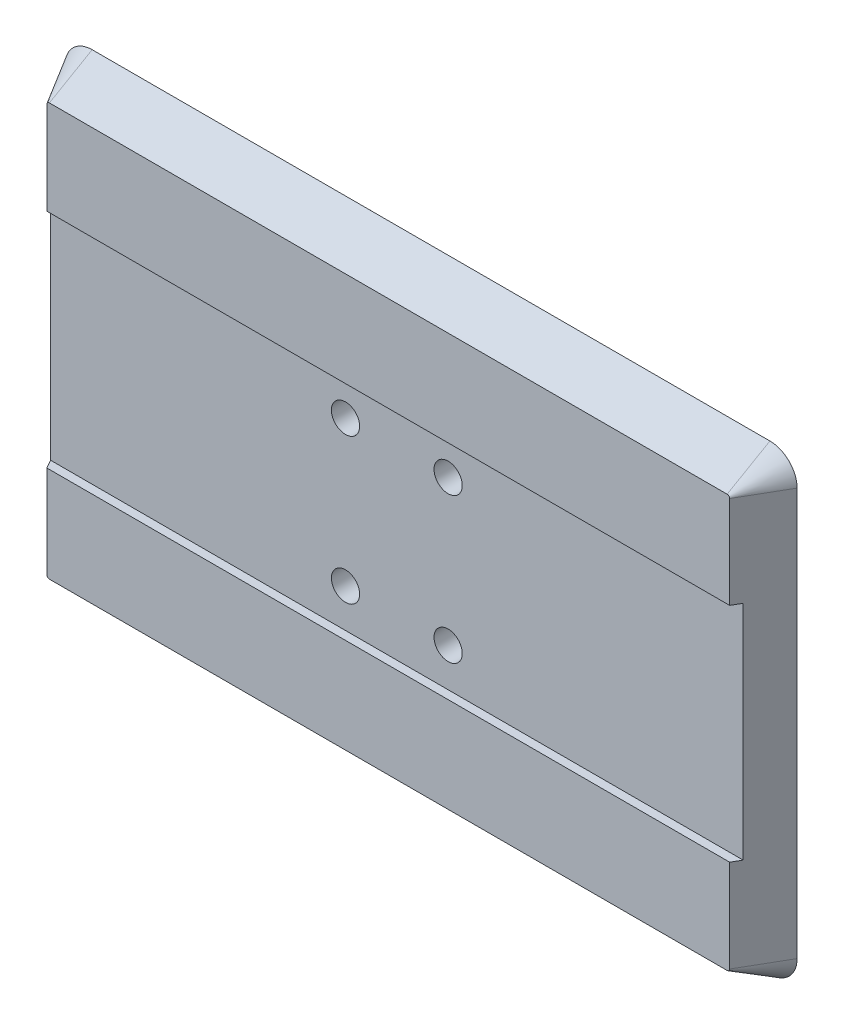
ISO-10303-21;
HEADER;
FILE_DESCRIPTION(('STEP AP214'),'2;1');
FILE_NAME('part.step','',(''),(''),'','','');
FILE_SCHEMA(('AUTOMOTIVE_DESIGN { 1 0 10303 214 1 1 1 1 }'));
ENDSEC;
DATA;
#1=APPLICATION_CONTEXT('core data for automotive mechanical design processes');
#2=APPLICATION_PROTOCOL_DEFINITION('international standard','automotive_design',2000,#1);
#3=PRODUCT_CONTEXT('',#1,'mechanical');
#4=PRODUCT('Part','Part','',(#3));
#5=PRODUCT_RELATED_PRODUCT_CATEGORY('part','',(#4));
#6=PRODUCT_DEFINITION_FORMATION('','',#4);
#7=PRODUCT_DEFINITION_CONTEXT('part definition',#1,'design');
#8=PRODUCT_DEFINITION('design','',#6,#7);
#9=PRODUCT_DEFINITION_SHAPE('','',#8);
#10=(LENGTH_UNIT() NAMED_UNIT(*) SI_UNIT(.MILLI.,.METRE.));
#11=(NAMED_UNIT(*) PLANE_ANGLE_UNIT() SI_UNIT($,.RADIAN.));
#12=(NAMED_UNIT(*) SI_UNIT($,.STERADIAN.) SOLID_ANGLE_UNIT());
#13=UNCERTAINTY_MEASURE_WITH_UNIT(LENGTH_MEASURE(1.E-05),#10,'distance_accuracy_value','');
#14=(GEOMETRIC_REPRESENTATION_CONTEXT(3) GLOBAL_UNCERTAINTY_ASSIGNED_CONTEXT((#13)) GLOBAL_UNIT_ASSIGNED_CONTEXT((#10,
#11,#12)) REPRESENTATION_CONTEXT('',''));
#15=CARTESIAN_POINT('',(0.,0.,0.));
#16=DIRECTION('',(0.,0.,1.));
#17=DIRECTION('',(1.,0.,0.));
#18=AXIS2_PLACEMENT_3D('',#15,#16,#17);
#19=CARTESIAN_POINT('',(82.42,3.18,5.));
#20=DIRECTION('',(0.,0.,1.));
#21=DIRECTION('',(1.,0.,0.));
#22=AXIS2_PLACEMENT_3D('',#19,#20,#21);
#23=PLANE('',#22);
#24=DIRECTION('',(-1.,0.,0.));
#25=VECTOR('',#24,1.);
#26=CARTESIAN_POINT('',(2.88675134594812,40.,5.));
#27=LINE('',#26,#25);
#28=CARTESIAN_POINT('',(82.7132486540519,40.,5.));
#29=VERTEX_POINT('',#28);
#30=CARTESIAN_POINT('',(2.88675134594812,40.,5.));
#31=VERTEX_POINT('',#30);
#32=EDGE_CURVE('E143',#29,#31,#27,.T.);
#33=ORIENTED_EDGE('',*,*,#32,.F.);
#34=DIRECTION('',(0.,1.,0.));
#35=VECTOR('',#34,1.);
#36=CARTESIAN_POINT('',(82.7132486540519,50.82,5.));
#37=LINE('',#36,#35);
#38=CARTESIAN_POINT('',(82.7132486540519,50.82,5.));
#39=VERTEX_POINT('',#38);
#40=EDGE_CURVE('E61',#29,#39,#37,.T.);
#41=ORIENTED_EDGE('',*,*,#40,.T.);
#42=CARTESIAN_POINT('',(82.42,50.82,5.));
#43=DIRECTION('',(0.,0.,1.));
#44=DIRECTION('',(1.,0.,0.));
#45=AXIS2_PLACEMENT_3D('',#42,#43,#44);
#46=CIRCLE('',#45,0.293248654051871);
#47=CARTESIAN_POINT('',(82.42,51.1132486540519,5.));
#48=VERTEX_POINT('',#47);
#49=EDGE_CURVE('E169',#39,#48,#46,.T.);
#50=ORIENTED_EDGE('',*,*,#49,.T.);
#51=DIRECTION('',(-1.,0.,0.));
#52=VECTOR('',#51,1.);
#53=CARTESIAN_POINT('',(3.18000000000002,51.1132486540519,5.));
#54=LINE('',#53,#52);
#55=CARTESIAN_POINT('',(3.18000000000002,51.1132486540519,5.));
#56=VERTEX_POINT('',#55);
#57=EDGE_CURVE('E165',#48,#56,#54,.T.);
#58=ORIENTED_EDGE('',*,*,#57,.T.);
#59=CARTESIAN_POINT('',(3.18,50.82,5.));
#60=DIRECTION('',(0.,0.,1.));
#61=DIRECTION('',(1.,0.,0.));
#62=AXIS2_PLACEMENT_3D('',#59,#60,#61);
#63=CIRCLE('',#62,0.29324865405187);
#64=CARTESIAN_POINT('',(2.88675134594812,50.82,5.));
#65=VERTEX_POINT('',#64);
#66=EDGE_CURVE('E161',#56,#65,#63,.T.);
#67=ORIENTED_EDGE('',*,*,#66,.T.);
#68=DIRECTION('',(0.,-1.,0.));
#69=VECTOR('',#68,1.);
#70=CARTESIAN_POINT('',(2.88675134594812,3.18,5.));
#71=LINE('',#70,#69);
#72=EDGE_CURVE('E150',#65,#31,#71,.T.);
#73=ORIENTED_EDGE('',*,*,#72,.T.);
#74=EDGE_LOOP('',(#33,#41,#50,#58,#67,#73));
#75=FACE_BOUND('',#74,.T.);
#76=ADVANCED_FACE('F37',(#75),#23,.T.);
#77=DIRECTION('',(1.,0.,0.));
#78=VECTOR('',#77,1.);
#79=CARTESIAN_POINT('',(2.88675134594812,14.,5.));
#80=LINE('',#79,#78);
#81=CARTESIAN_POINT('',(2.88675134594812,14.,5.));
#82=VERTEX_POINT('',#81);
#83=CARTESIAN_POINT('',(82.7132486540519,14.,5.));
#84=VERTEX_POINT('',#83);
#85=EDGE_CURVE('E129',#82,#84,#80,.T.);
#86=ORIENTED_EDGE('',*,*,#85,.F.);
#87=CARTESIAN_POINT('',(2.88675134594812,3.18,5.));
#88=VERTEX_POINT('',#87);
#89=EDGE_CURVE('E139',#82,#88,#71,.T.);
#90=ORIENTED_EDGE('',*,*,#89,.T.);
#91=CARTESIAN_POINT('',(3.18,3.18,5.));
#92=DIRECTION('',(0.,0.,1.));
#93=DIRECTION('',(1.,0.,0.));
#94=AXIS2_PLACEMENT_3D('',#91,#92,#93);
#95=CIRCLE('',#94,0.293248654051869);
#96=CARTESIAN_POINT('',(3.18000000000002,2.88675134594813,5.));
#97=VERTEX_POINT('',#96);
#98=EDGE_CURVE('E154',#88,#97,#95,.T.);
#99=ORIENTED_EDGE('',*,*,#98,.T.);
#100=DIRECTION('',(1.,0.,0.));
#101=VECTOR('',#100,1.);
#102=CARTESIAN_POINT('',(82.42,2.88675134594813,5.));
#103=LINE('',#102,#101);
#104=CARTESIAN_POINT('',(82.42,2.88675134594813,5.));
#105=VERTEX_POINT('',#104);
#106=EDGE_CURVE('E163',#97,#105,#103,.T.);
#107=ORIENTED_EDGE('',*,*,#106,.T.);
#108=CARTESIAN_POINT('',(82.42,3.18,5.));
#109=DIRECTION('',(0.,0.,1.));
#110=DIRECTION('',(1.,0.,0.));
#111=AXIS2_PLACEMENT_3D('',#108,#109,#110);
#112=CIRCLE('',#111,0.293248654051864);
#113=CARTESIAN_POINT('',(82.7132486540519,3.18000000000002,5.));
#114=VERTEX_POINT('',#113);
#115=EDGE_CURVE('E167',#105,#114,#112,.T.);
#116=ORIENTED_EDGE('',*,*,#115,.T.);
#117=EDGE_CURVE('E142',#114,#84,#37,.T.);
#118=ORIENTED_EDGE('',*,*,#117,.T.);
#119=EDGE_LOOP('',(#86,#90,#99,#107,#116,#118));
#120=FACE_BOUND('',#119,.T.);
#121=ADVANCED_FACE('F138',(#120),#23,.T.);
#122=CARTESIAN_POINT('',(82.42,3.18,0.));
#123=DIRECTION('',(0.,0.,1.));
#124=DIRECTION('',(1.,0.,0.));
#125=AXIS2_PLACEMENT_3D('',#122,#123,#124);
#126=PLANE('',#125);
#127=CARTESIAN_POINT('',(48.8,18.5,0.));
#128=DIRECTION('',(0.,0.,1.));
#129=DIRECTION('',(1.,0.,0.));
#130=AXIS2_PLACEMENT_3D('',#127,#128,#129);
#131=CIRCLE('',#130,1.64999999999999);
#132=CARTESIAN_POINT('',(50.45,18.5,0.));
#133=VERTEX_POINT('',#132);
#134=EDGE_CURVE('E271',#133,#133,#131,.T.);
#135=ORIENTED_EDGE('',*,*,#134,.T.);
#136=EDGE_LOOP('',(#135));
#137=FACE_BOUND('',#136,.T.);
#138=CARTESIAN_POINT('',(48.8,35.5,0.));
#139=DIRECTION('',(0.,0.,1.));
#140=DIRECTION('',(1.,0.,0.));
#141=AXIS2_PLACEMENT_3D('',#138,#139,#140);
#142=CIRCLE('',#141,1.64999999999999);
#143=CARTESIAN_POINT('',(50.45,35.5,0.));
#144=VERTEX_POINT('',#143);
#145=EDGE_CURVE('E265',#144,#144,#142,.T.);
#146=ORIENTED_EDGE('',*,*,#145,.T.);
#147=EDGE_LOOP('',(#146));
#148=FACE_BOUND('',#147,.T.);
#149=CARTESIAN_POINT('',(36.8,18.5,0.));
#150=DIRECTION('',(0.,0.,1.));
#151=DIRECTION('',(1.,0.,0.));
#152=AXIS2_PLACEMENT_3D('',#149,#150,#151);
#153=CIRCLE('',#152,1.64999999999999);
#154=CARTESIAN_POINT('',(38.45,18.5,0.));
#155=VERTEX_POINT('',#154);
#156=EDGE_CURVE('E259',#155,#155,#153,.T.);
#157=ORIENTED_EDGE('',*,*,#156,.T.);
#158=EDGE_LOOP('',(#157));
#159=FACE_BOUND('',#158,.T.);
#160=CARTESIAN_POINT('',(36.8,35.5,0.));
#161=DIRECTION('',(0.,0.,1.));
#162=DIRECTION('',(1.,0.,0.));
#163=AXIS2_PLACEMENT_3D('',#160,#161,#162);
#164=CIRCLE('',#163,1.64999999999999);
#165=CARTESIAN_POINT('',(38.45,35.5,0.));
#166=VERTEX_POINT('',#165);
#167=EDGE_CURVE('E41',#166,#166,#164,.T.);
#168=ORIENTED_EDGE('',*,*,#167,.T.);
#169=EDGE_LOOP('',(#168));
#170=FACE_BOUND('',#169,.T.);
#171=CARTESIAN_POINT('',(82.42,3.18,0.));
#172=DIRECTION('',(0.,0.,1.));
#173=DIRECTION('',(1.,0.,0.));
#174=AXIS2_PLACEMENT_3D('',#171,#172,#173);
#175=CIRCLE('',#174,3.18);
#176=CARTESIAN_POINT('',(82.42,0.,0.));
#177=VERTEX_POINT('',#176);
#178=CARTESIAN_POINT('',(85.6,3.18000000000002,0.));
#179=VERTEX_POINT('',#178);
#180=EDGE_CURVE('E194',#177,#179,#175,.T.);
#181=ORIENTED_EDGE('',*,*,#180,.F.);
#182=DIRECTION('',(1.,0.,0.));
#183=VECTOR('',#182,1.);
#184=CARTESIAN_POINT('',(3.18000000000002,0.,0.));
#185=LINE('',#184,#183);
#186=CARTESIAN_POINT('',(3.18000000000002,0.,0.));
#187=VERTEX_POINT('',#186);
#188=EDGE_CURVE('E151',#187,#177,#185,.T.);
#189=ORIENTED_EDGE('',*,*,#188,.F.);
#190=CARTESIAN_POINT('',(3.18,3.18,0.));
#191=DIRECTION('',(0.,0.,1.));
#192=DIRECTION('',(-1.,0.,0.));
#193=AXIS2_PLACEMENT_3D('',#190,#191,#192);
#194=CIRCLE('',#193,3.18);
#195=CARTESIAN_POINT('',(0.,3.18,0.));
#196=VERTEX_POINT('',#195);
#197=EDGE_CURVE('E156',#196,#187,#194,.T.);
#198=ORIENTED_EDGE('',*,*,#197,.F.);
#199=DIRECTION('',(0.,-1.,0.));
#200=VECTOR('',#199,1.);
#201=CARTESIAN_POINT('',(0.,3.18000000000002,0.));
#202=LINE('',#201,#200);
#203=CARTESIAN_POINT('',(0.,50.82,0.));
#204=VERTEX_POINT('',#203);
#205=EDGE_CURVE('E225',#204,#196,#202,.T.);
#206=ORIENTED_EDGE('',*,*,#205,.F.);
#207=CARTESIAN_POINT('',(3.18,50.82,0.));
#208=DIRECTION('',(0.,0.,1.));
#209=DIRECTION('',(-1.,0.,0.));
#210=AXIS2_PLACEMENT_3D('',#207,#208,#209);
#211=CIRCLE('',#210,3.18);
#212=CARTESIAN_POINT('',(3.18000000000002,54.,0.));
#213=VERTEX_POINT('',#212);
#214=EDGE_CURVE('E222',#213,#204,#211,.T.);
#215=ORIENTED_EDGE('',*,*,#214,.F.);
#216=DIRECTION('',(-1.,0.,0.));
#217=VECTOR('',#216,1.);
#218=CARTESIAN_POINT('',(3.18000000000002,54.,0.));
#219=LINE('',#218,#217);
#220=CARTESIAN_POINT('',(82.42,54.,0.));
#221=VERTEX_POINT('',#220);
#222=EDGE_CURVE('E219',#221,#213,#219,.T.);
#223=ORIENTED_EDGE('',*,*,#222,.F.);
#224=CARTESIAN_POINT('',(82.42,50.82,0.));
#225=DIRECTION('',(0.,0.,1.));
#226=DIRECTION('',(1.,0.,0.));
#227=AXIS2_PLACEMENT_3D('',#224,#225,#226);
#228=CIRCLE('',#227,3.18);
#229=CARTESIAN_POINT('',(85.6,50.82,0.));
#230=VERTEX_POINT('',#229);
#231=EDGE_CURVE('E216',#230,#221,#228,.T.);
#232=ORIENTED_EDGE('',*,*,#231,.F.);
#233=DIRECTION('',(0.,1.,0.));
#234=VECTOR('',#233,1.);
#235=CARTESIAN_POINT('',(85.6,3.18000000000002,0.));
#236=LINE('',#235,#234);
#237=EDGE_CURVE('E213',#179,#230,#236,.T.);
#238=ORIENTED_EDGE('',*,*,#237,.F.);
#239=EDGE_LOOP('',(#181,#189,#198,#206,#215,#223,#232,#238));
#240=FACE_BOUND('',#239,.T.);
#241=ADVANCED_FACE('F298',(#137,#148,#159,#170,#240),#126,.F.);
#242=CARTESIAN_POINT('',(2.88675134594812,3.18,5.));
#243=DIRECTION('',(-0.86602540378444,0.,0.499999999999997));
#244=DIRECTION('',(0.,1.,0.));
#245=AXIS2_PLACEMENT_3D('',#242,#243,#244);
#246=PLANE('',#245);
#247=DIRECTION('',(-0.499999999999997,0.,-0.86602540378444));
#248=VECTOR('',#247,1.);
#249=CARTESIAN_POINT('',(2.88675134594812,40.,5.));
#250=LINE('',#249,#248);
#251=CARTESIAN_POINT('',(2.3094010767585,40.,4.));
#252=VERTEX_POINT('',#251);
#253=EDGE_CURVE('E144',#31,#252,#250,.T.);
#254=ORIENTED_EDGE('',*,*,#253,.F.);
#255=ORIENTED_EDGE('',*,*,#72,.F.);
#256=DIRECTION('',(0.499999999999997,0.,0.86602540378444));
#257=VECTOR('',#256,1.);
#258=CARTESIAN_POINT('',(0.,50.82,0.));
#259=LINE('',#258,#257);
#260=EDGE_CURVE('E190',#204,#65,#259,.T.);
#261=ORIENTED_EDGE('',*,*,#260,.F.);
#262=ORIENTED_EDGE('',*,*,#205,.T.);
#263=DIRECTION('',(-0.499999999999997,0.,-0.86602540378444));
#264=VECTOR('',#263,1.);
#265=CARTESIAN_POINT('',(2.88675134594812,3.18,5.));
#266=LINE('',#265,#264);
#267=EDGE_CURVE('E148',#88,#196,#266,.T.);
#268=ORIENTED_EDGE('',*,*,#267,.F.);
#269=ORIENTED_EDGE('',*,*,#89,.F.);
#270=DIRECTION('',(0.499999999999997,0.,0.86602540378444));
#271=VECTOR('',#270,1.);
#272=CARTESIAN_POINT('',(2.88675134594812,14.,5.));
#273=LINE('',#272,#271);
#274=CARTESIAN_POINT('',(2.3094010767585,14.,4.));
#275=VERTEX_POINT('',#274);
#276=EDGE_CURVE('E126',#275,#82,#273,.T.);
#277=ORIENTED_EDGE('',*,*,#276,.F.);
#278=DIRECTION('',(0.,-1.,0.));
#279=VECTOR('',#278,1.);
#280=CARTESIAN_POINT('',(2.3094010767585,3.18,4.));
#281=LINE('',#280,#279);
#282=EDGE_CURVE('E134',#252,#275,#281,.T.);
#283=ORIENTED_EDGE('',*,*,#282,.F.);
#284=EDGE_LOOP('',(#254,#255,#261,#262,#268,#269,#277,#283));
#285=FACE_BOUND('',#284,.T.);
#286=ADVANCED_FACE('F39',(#285),#246,.T.);
#287=CARTESIAN_POINT('',(3.18,3.18,5.));
#288=DIRECTION('',(0.,0.,-1.));
#289=DIRECTION('',(-1.,0.,0.));
#290=AXIS2_PLACEMENT_3D('',#287,#288,#289);
#291=CONICAL_SURFACE('',#290,0.293248654051869,0.523598775598296);
#292=ORIENTED_EDGE('',*,*,#267,.T.);
#293=ORIENTED_EDGE('',*,*,#197,.T.);
#294=DIRECTION('',(0.,-0.499999999999998,-0.86602540378444));
#295=VECTOR('',#294,1.);
#296=CARTESIAN_POINT('',(3.18000000000002,2.88675134594813,5.));
#297=LINE('',#296,#295);
#298=EDGE_CURVE('E187',#97,#187,#297,.T.);
#299=ORIENTED_EDGE('',*,*,#298,.F.);
#300=ORIENTED_EDGE('',*,*,#98,.F.);
#301=EDGE_LOOP('',(#292,#293,#299,#300));
#302=FACE_BOUND('',#301,.T.);
#303=ADVANCED_FACE('F229',(#302),#291,.T.);
#304=CARTESIAN_POINT('',(3.18,50.82,5.));
#305=DIRECTION('',(0.,0.,-1.));
#306=DIRECTION('',(-1.,0.,0.));
#307=AXIS2_PLACEMENT_3D('',#304,#305,#306);
#308=CONICAL_SURFACE('',#307,0.29324865405187,0.523598775598296);
#309=ORIENTED_EDGE('',*,*,#260,.T.);
#310=ORIENTED_EDGE('',*,*,#66,.F.);
#311=DIRECTION('',(0.,-0.499999999999998,0.86602540378444));
#312=VECTOR('',#311,1.);
#313=CARTESIAN_POINT('',(3.18000000000002,54.,0.));
#314=LINE('',#313,#312);
#315=EDGE_CURVE('E184',#213,#56,#314,.T.);
#316=ORIENTED_EDGE('',*,*,#315,.F.);
#317=ORIENTED_EDGE('',*,*,#214,.T.);
#318=EDGE_LOOP('',(#309,#310,#316,#317));
#319=FACE_BOUND('',#318,.T.);
#320=ADVANCED_FACE('F251',(#319),#308,.T.);
#321=CARTESIAN_POINT('',(82.42,2.88675134594813,5.));
#322=DIRECTION('',(0.,-0.86602540378444,0.499999999999998));
#323=DIRECTION('',(-1.,0.,0.));
#324=AXIS2_PLACEMENT_3D('',#321,#322,#323);
#325=PLANE('',#324);
#326=ORIENTED_EDGE('',*,*,#298,.T.);
#327=ORIENTED_EDGE('',*,*,#188,.T.);
#328=DIRECTION('',(0.,-0.499999999999998,-0.86602540378444));
#329=VECTOR('',#328,1.);
#330=CARTESIAN_POINT('',(82.42,2.88675134594813,5.));
#331=LINE('',#330,#329);
#332=EDGE_CURVE('E181',#105,#177,#331,.T.);
#333=ORIENTED_EDGE('',*,*,#332,.F.);
#334=ORIENTED_EDGE('',*,*,#106,.F.);
#335=EDGE_LOOP('',(#326,#327,#333,#334));
#336=FACE_BOUND('',#335,.T.);
#337=ADVANCED_FACE('F233',(#336),#325,.T.);
#338=CARTESIAN_POINT('',(82.42,51.1132486540519,5.));
#339=DIRECTION('',(0.,0.86602540378444,0.499999999999998));
#340=DIRECTION('',(1.,0.,0.));
#341=AXIS2_PLACEMENT_3D('',#338,#339,#340);
#342=PLANE('',#341);
#343=ORIENTED_EDGE('',*,*,#315,.T.);
#344=ORIENTED_EDGE('',*,*,#57,.F.);
#345=DIRECTION('',(0.,-0.499999999999998,0.86602540378444));
#346=VECTOR('',#345,1.);
#347=CARTESIAN_POINT('',(82.42,54.,0.));
#348=LINE('',#347,#346);
#349=EDGE_CURVE('E178',#221,#48,#348,.T.);
#350=ORIENTED_EDGE('',*,*,#349,.F.);
#351=ORIENTED_EDGE('',*,*,#222,.T.);
#352=EDGE_LOOP('',(#343,#344,#350,#351));
#353=FACE_BOUND('',#352,.T.);
#354=ADVANCED_FACE('F248',(#353),#342,.T.);
#355=CARTESIAN_POINT('',(82.42,3.18,5.));
#356=DIRECTION('',(0.,0.,-1.));
#357=DIRECTION('',(-1.,0.,0.));
#358=AXIS2_PLACEMENT_3D('',#355,#356,#357);
#359=CONICAL_SURFACE('',#358,0.293248654051864,0.523598775598297);
#360=ORIENTED_EDGE('',*,*,#332,.T.);
#361=ORIENTED_EDGE('',*,*,#180,.T.);
#362=DIRECTION('',(0.499999999999999,0.,-0.866025403784439));
#363=VECTOR('',#362,1.);
#364=CARTESIAN_POINT('',(82.7132486540519,3.18000000000002,5.));
#365=LINE('',#364,#363);
#366=EDGE_CURVE('E175',#114,#179,#365,.T.);
#367=ORIENTED_EDGE('',*,*,#366,.F.);
#368=ORIENTED_EDGE('',*,*,#115,.F.);
#369=EDGE_LOOP('',(#360,#361,#367,#368));
#370=FACE_BOUND('',#369,.T.);
#371=ADVANCED_FACE('F238',(#370),#359,.T.);
#372=CARTESIAN_POINT('',(82.42,50.82,5.));
#373=DIRECTION('',(0.,0.,-1.));
#374=DIRECTION('',(-1.,0.,0.));
#375=AXIS2_PLACEMENT_3D('',#372,#373,#374);
#376=CONICAL_SURFACE('',#375,0.293248654051871,0.523598775598296);
#377=ORIENTED_EDGE('',*,*,#349,.T.);
#378=ORIENTED_EDGE('',*,*,#49,.F.);
#379=DIRECTION('',(-0.499999999999999,0.,0.866025403784439));
#380=VECTOR('',#379,1.);
#381=CARTESIAN_POINT('',(85.6,50.82,0.));
#382=LINE('',#381,#380);
#383=EDGE_CURVE('E173',#230,#39,#382,.T.);
#384=ORIENTED_EDGE('',*,*,#383,.F.);
#385=ORIENTED_EDGE('',*,*,#231,.T.);
#386=EDGE_LOOP('',(#377,#378,#384,#385));
#387=FACE_BOUND('',#386,.T.);
#388=ADVANCED_FACE('F243',(#387),#376,.T.);
#389=CARTESIAN_POINT('',(82.7132486540519,3.18,5.));
#390=DIRECTION('',(0.866025403784439,0.,0.499999999999999));
#391=DIRECTION('',(0.,-1.,0.));
#392=AXIS2_PLACEMENT_3D('',#389,#390,#391);
#393=PLANE('',#392);
#394=DIRECTION('',(-0.499999999999999,0.,0.866025403784439));
#395=VECTOR('',#394,1.);
#396=CARTESIAN_POINT('',(82.7132486540519,40.,5.));
#397=LINE('',#396,#395);
#398=CARTESIAN_POINT('',(83.2905989232415,40.,4.));
#399=VERTEX_POINT('',#398);
#400=EDGE_CURVE('E11',#399,#29,#397,.T.);
#401=ORIENTED_EDGE('',*,*,#400,.F.);
#402=DIRECTION('',(0.,-1.,0.));
#403=VECTOR('',#402,1.);
#404=CARTESIAN_POINT('',(83.2905989232415,3.18,4.));
#405=LINE('',#404,#403);
#406=CARTESIAN_POINT('',(83.2905989232415,14.,4.));
#407=VERTEX_POINT('',#406);
#408=EDGE_CURVE('E172',#399,#407,#405,.T.);
#409=ORIENTED_EDGE('',*,*,#408,.T.);
#410=DIRECTION('',(0.499999999999999,0.,-0.866025403784439));
#411=VECTOR('',#410,1.);
#412=CARTESIAN_POINT('',(82.7132486540519,14.,5.));
#413=LINE('',#412,#411);
#414=EDGE_CURVE('E46',#84,#407,#413,.T.);
#415=ORIENTED_EDGE('',*,*,#414,.F.);
#416=ORIENTED_EDGE('',*,*,#117,.F.);
#417=ORIENTED_EDGE('',*,*,#366,.T.);
#418=ORIENTED_EDGE('',*,*,#237,.T.);
#419=ORIENTED_EDGE('',*,*,#383,.T.);
#420=ORIENTED_EDGE('',*,*,#40,.F.);
#421=EDGE_LOOP('',(#401,#409,#415,#416,#417,#418,#419,#420));
#422=FACE_BOUND('',#421,.T.);
#423=ADVANCED_FACE('F199',(#422),#393,.T.);
#424=CARTESIAN_POINT('',(2.88675134594812,40.,4.));
#425=DIRECTION('',(0.,1.,0.));
#426=DIRECTION('',(0.,0.,1.));
#427=AXIS2_PLACEMENT_3D('',#424,#425,#426);
#428=PLANE('',#427);
#429=ORIENTED_EDGE('',*,*,#400,.T.);
#430=ORIENTED_EDGE('',*,*,#32,.T.);
#431=ORIENTED_EDGE('',*,*,#253,.T.);
#432=DIRECTION('',(-1.,0.,0.));
#433=VECTOR('',#432,1.);
#434=CARTESIAN_POINT('',(2.88675134594812,40.,4.));
#435=LINE('',#434,#433);
#436=EDGE_CURVE('E176',#399,#252,#435,.T.);
#437=ORIENTED_EDGE('',*,*,#436,.F.);
#438=EDGE_LOOP('',(#429,#430,#431,#437));
#439=FACE_BOUND('',#438,.T.);
#440=ADVANCED_FACE('F204',(#439),#428,.F.);
#441=CARTESIAN_POINT('',(2.88675134594812,14.,4.));
#442=DIRECTION('',(0.,-1.,0.));
#443=DIRECTION('',(1.,0.,0.));
#444=AXIS2_PLACEMENT_3D('',#441,#442,#443);
#445=PLANE('',#444);
#446=ORIENTED_EDGE('',*,*,#414,.T.);
#447=DIRECTION('',(1.,0.,0.));
#448=VECTOR('',#447,1.);
#449=CARTESIAN_POINT('',(2.88675134594812,14.,4.));
#450=LINE('',#449,#448);
#451=EDGE_CURVE('E53',#275,#407,#450,.T.);
#452=ORIENTED_EDGE('',*,*,#451,.F.);
#453=ORIENTED_EDGE('',*,*,#276,.T.);
#454=ORIENTED_EDGE('',*,*,#85,.T.);
#455=EDGE_LOOP('',(#446,#452,#453,#454));
#456=FACE_BOUND('',#455,.T.);
#457=ADVANCED_FACE('F128',(#456),#445,.F.);
#458=CARTESIAN_POINT('',(0.,0.,4.));
#459=DIRECTION('',(0.,0.,1.));
#460=DIRECTION('',(1.,0.,0.));
#461=AXIS2_PLACEMENT_3D('',#458,#459,#460);
#462=PLANE('',#461);
#463=CARTESIAN_POINT('',(48.8,18.5,4.));
#464=DIRECTION('',(0.,0.,1.));
#465=DIRECTION('',(1.,0.,0.));
#466=AXIS2_PLACEMENT_3D('',#463,#464,#465);
#467=CIRCLE('',#466,1.64999999999999);
#468=CARTESIAN_POINT('',(50.45,18.5,4.));
#469=VERTEX_POINT('',#468);
#470=EDGE_CURVE('E274',#469,#469,#467,.T.);
#471=ORIENTED_EDGE('',*,*,#470,.F.);
#472=EDGE_LOOP('',(#471));
#473=FACE_BOUND('',#472,.T.);
#474=CARTESIAN_POINT('',(48.8,35.5,4.));
#475=DIRECTION('',(0.,0.,1.));
#476=DIRECTION('',(1.,0.,0.));
#477=AXIS2_PLACEMENT_3D('',#474,#475,#476);
#478=CIRCLE('',#477,1.64999999999999);
#479=CARTESIAN_POINT('',(50.45,35.5,4.));
#480=VERTEX_POINT('',#479);
#481=EDGE_CURVE('E268',#480,#480,#478,.T.);
#482=ORIENTED_EDGE('',*,*,#481,.F.);
#483=EDGE_LOOP('',(#482));
#484=FACE_BOUND('',#483,.T.);
#485=CARTESIAN_POINT('',(36.8,18.5,4.));
#486=DIRECTION('',(0.,0.,1.));
#487=DIRECTION('',(1.,0.,0.));
#488=AXIS2_PLACEMENT_3D('',#485,#486,#487);
#489=CIRCLE('',#488,1.64999999999999);
#490=CARTESIAN_POINT('',(38.45,18.5,4.));
#491=VERTEX_POINT('',#490);
#492=EDGE_CURVE('E262',#491,#491,#489,.T.);
#493=ORIENTED_EDGE('',*,*,#492,.F.);
#494=EDGE_LOOP('',(#493));
#495=FACE_BOUND('',#494,.T.);
#496=CARTESIAN_POINT('',(36.8,35.5,4.));
#497=DIRECTION('',(0.,0.,1.));
#498=DIRECTION('',(1.,0.,0.));
#499=AXIS2_PLACEMENT_3D('',#496,#497,#498);
#500=CIRCLE('',#499,1.64999999999999);
#501=CARTESIAN_POINT('',(38.45,35.5,4.));
#502=VERTEX_POINT('',#501);
#503=EDGE_CURVE('E256',#502,#502,#500,.T.);
#504=ORIENTED_EDGE('',*,*,#503,.F.);
#505=EDGE_LOOP('',(#504));
#506=FACE_BOUND('',#505,.T.);
#507=ORIENTED_EDGE('',*,*,#436,.T.);
#508=ORIENTED_EDGE('',*,*,#282,.T.);
#509=ORIENTED_EDGE('',*,*,#451,.T.);
#510=ORIENTED_EDGE('',*,*,#408,.F.);
#511=EDGE_LOOP('',(#507,#508,#509,#510));
#512=FACE_BOUND('',#511,.T.);
#513=ADVANCED_FACE('F201',(#473,#484,#495,#506,#512),#462,.T.);
#514=CARTESIAN_POINT('',(36.8,35.5,4.));
#515=DIRECTION('',(0.,0.,1.));
#516=DIRECTION('',(1.,0.,0.));
#517=AXIS2_PLACEMENT_3D('',#514,#515,#516);
#518=CYLINDRICAL_SURFACE('',#517,1.64999999999999);
#519=ORIENTED_EDGE('',*,*,#503,.T.);
#520=EDGE_LOOP('',(#519));
#521=FACE_BOUND('',#520,.T.);
#522=ORIENTED_EDGE('',*,*,#167,.F.);
#523=EDGE_LOOP('',(#522));
#524=FACE_BOUND('',#523,.T.);
#525=ADVANCED_FACE('F283',(#521,#524),#518,.F.);
#526=CARTESIAN_POINT('',(36.8,18.5,4.));
#527=DIRECTION('',(0.,0.,1.));
#528=DIRECTION('',(1.,0.,0.));
#529=AXIS2_PLACEMENT_3D('',#526,#527,#528);
#530=CYLINDRICAL_SURFACE('',#529,1.64999999999999);
#531=ORIENTED_EDGE('',*,*,#492,.T.);
#532=EDGE_LOOP('',(#531));
#533=FACE_BOUND('',#532,.T.);
#534=ORIENTED_EDGE('',*,*,#156,.F.);
#535=EDGE_LOOP('',(#534));
#536=FACE_BOUND('',#535,.T.);
#537=ADVANCED_FACE('F293',(#533,#536),#530,.F.);
#538=CARTESIAN_POINT('',(48.8,35.5,4.));
#539=DIRECTION('',(0.,0.,1.));
#540=DIRECTION('',(1.,0.,0.));
#541=AXIS2_PLACEMENT_3D('',#538,#539,#540);
#542=CYLINDRICAL_SURFACE('',#541,1.64999999999999);
#543=ORIENTED_EDGE('',*,*,#481,.T.);
#544=EDGE_LOOP('',(#543));
#545=FACE_BOUND('',#544,.T.);
#546=ORIENTED_EDGE('',*,*,#145,.F.);
#547=EDGE_LOOP('',(#546));
#548=FACE_BOUND('',#547,.T.);
#549=ADVANCED_FACE('F319',(#545,#548),#542,.F.);
#550=CARTESIAN_POINT('',(48.8,18.5,4.));
#551=DIRECTION('',(0.,0.,1.));
#552=DIRECTION('',(1.,0.,0.));
#553=AXIS2_PLACEMENT_3D('',#550,#551,#552);
#554=CYLINDRICAL_SURFACE('',#553,1.64999999999999);
#555=ORIENTED_EDGE('',*,*,#470,.T.);
#556=EDGE_LOOP('',(#555));
#557=FACE_BOUND('',#556,.T.);
#558=ORIENTED_EDGE('',*,*,#134,.F.);
#559=EDGE_LOOP('',(#558));
#560=FACE_BOUND('',#559,.T.);
#561=ADVANCED_FACE('F278',(#557,#560),#554,.F.);
#562=CLOSED_SHELL('',(#76,#121,#241,#286,#303,#320,#337,#354,#371,#388,#423,#440,#457,#513,#525,
#537,#549,#561));
#563=MANIFOLD_SOLID_BREP('B2',#562);
#564=ADVANCED_BREP_SHAPE_REPRESENTATION('',(#18,#563),#14);
#565=SHAPE_DEFINITION_REPRESENTATION(#9,#564);
ENDSEC;
END-ISO-10303-21;
